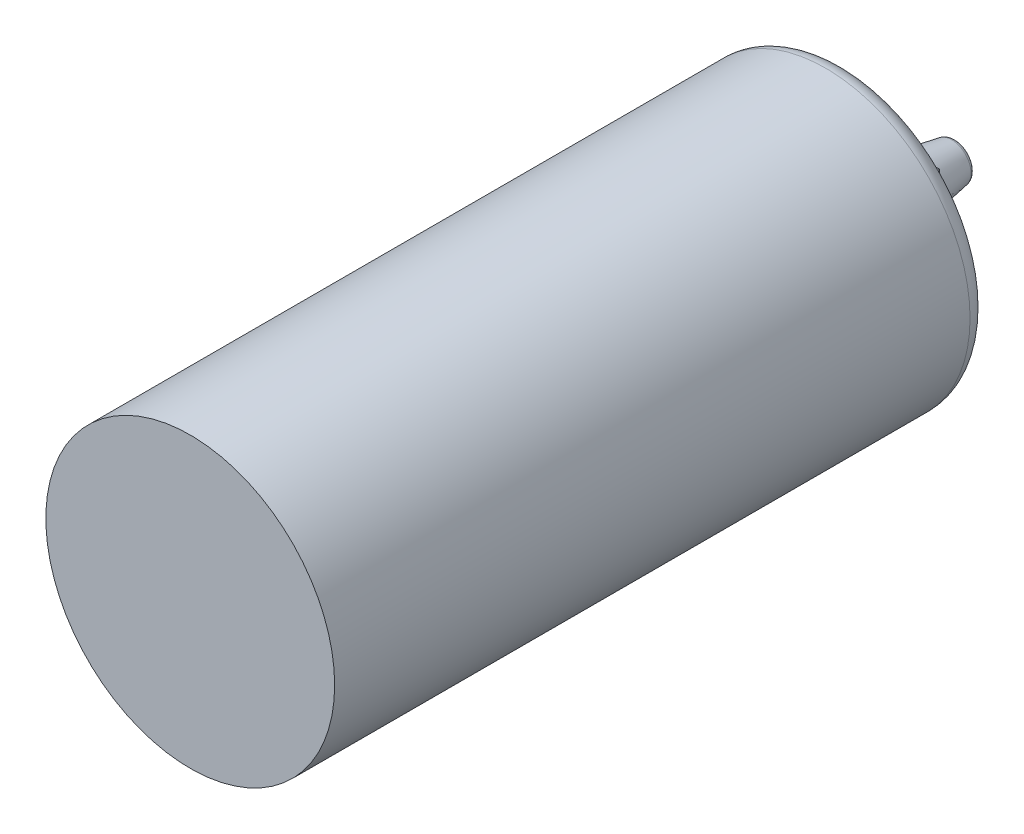
ISO-10303-21;
HEADER;
FILE_DESCRIPTION(('STEP AP214'),'2;1');
FILE_NAME('part.step','',(''),(''),'','','');
FILE_SCHEMA(('AUTOMOTIVE_DESIGN { 1 0 10303 214 1 1 1 1 }'));
ENDSEC;
DATA;
#1=APPLICATION_CONTEXT('core data for automotive mechanical design processes');
#2=APPLICATION_PROTOCOL_DEFINITION('international standard','automotive_design',2000,#1);
#3=PRODUCT_CONTEXT('',#1,'mechanical');
#4=PRODUCT('Part','Part','',(#3));
#5=PRODUCT_RELATED_PRODUCT_CATEGORY('part','',(#4));
#6=PRODUCT_DEFINITION_FORMATION('','',#4);
#7=PRODUCT_DEFINITION_CONTEXT('part definition',#1,'design');
#8=PRODUCT_DEFINITION('design','',#6,#7);
#9=PRODUCT_DEFINITION_SHAPE('','',#8);
#10=(LENGTH_UNIT() NAMED_UNIT(*) SI_UNIT(.MILLI.,.METRE.));
#11=(NAMED_UNIT(*) PLANE_ANGLE_UNIT() SI_UNIT($,.RADIAN.));
#12=(NAMED_UNIT(*) SI_UNIT($,.STERADIAN.) SOLID_ANGLE_UNIT());
#13=UNCERTAINTY_MEASURE_WITH_UNIT(LENGTH_MEASURE(1.E-05),#10,'distance_accuracy_value','');
#14=(GEOMETRIC_REPRESENTATION_CONTEXT(3) GLOBAL_UNCERTAINTY_ASSIGNED_CONTEXT((#13)) GLOBAL_UNIT_ASSIGNED_CONTEXT((#10,
#11,#12)) REPRESENTATION_CONTEXT('',''));
#15=CARTESIAN_POINT('',(0.,0.,0.));
#16=DIRECTION('',(0.,0.,1.));
#17=DIRECTION('',(1.,0.,0.));
#18=AXIS2_PLACEMENT_3D('',#15,#16,#17);
#19=CARTESIAN_POINT('',(0.,0.,-1.27));
#20=DIRECTION('',(0.,0.,1.));
#21=DIRECTION('',(1.,0.,0.));
#22=AXIS2_PLACEMENT_3D('',#19,#20,#21);
#23=PLANE('',#22);
#24=CARTESIAN_POINT('',(5.715,-5.715,-1.27));
#25=DIRECTION('',(0.,0.,1.));
#26=DIRECTION('',(1.,0.,0.));
#27=AXIS2_PLACEMENT_3D('',#24,#25,#26);
#28=CIRCLE('',#27,3.81);
#29=CARTESIAN_POINT('',(9.525,-5.715,-1.27));
#30=VERTEX_POINT('',#29);
#31=EDGE_CURVE('E147',#30,#30,#28,.F.);
#32=ORIENTED_EDGE('',*,*,#31,.F.);
#33=EDGE_LOOP('',(#32));
#34=FACE_BOUND('',#33,.T.);
#35=CARTESIAN_POINT('',(5.715,5.715,-1.27));
#36=DIRECTION('',(0.,0.,1.));
#37=DIRECTION('',(1.,0.,0.));
#38=AXIS2_PLACEMENT_3D('',#35,#36,#37);
#39=CIRCLE('',#38,3.81);
#40=CARTESIAN_POINT('',(9.525,5.715,-1.27));
#41=VERTEX_POINT('',#40);
#42=EDGE_CURVE('E141',#41,#41,#39,.F.);
#43=ORIENTED_EDGE('',*,*,#42,.F.);
#44=EDGE_LOOP('',(#43));
#45=FACE_BOUND('',#44,.T.);
#46=DIRECTION('',(0.,-1.,0.));
#47=VECTOR('',#46,1.);
#48=CARTESIAN_POINT('',(-11.2060647345003,0.,-1.27));
#49=LINE('',#48,#47);
#50=CARTESIAN_POINT('',(-11.2060647345003,-11.2060647345002,-1.27));
#51=VERTEX_POINT('',#50);
#52=CARTESIAN_POINT('',(-11.2060647345003,11.2060647345003,-1.27));
#53=VERTEX_POINT('',#52);
#54=EDGE_CURVE('E112',#51,#53,#49,.F.);
#55=ORIENTED_EDGE('',*,*,#54,.T.);
#56=DIRECTION('',(-1.,0.,0.));
#57=VECTOR('',#56,1.);
#58=CARTESIAN_POINT('',(0.,11.2060647345003,-1.27));
#59=LINE('',#58,#57);
#60=CARTESIAN_POINT('',(11.2060647345002,11.2060647345003,-1.27));
#61=VERTEX_POINT('',#60);
#62=EDGE_CURVE('E128',#53,#61,#59,.F.);
#63=ORIENTED_EDGE('',*,*,#62,.T.);
#64=DIRECTION('',(0.,1.,0.));
#65=VECTOR('',#64,1.);
#66=CARTESIAN_POINT('',(11.2060647345002,0.,-1.27));
#67=LINE('',#66,#65);
#68=CARTESIAN_POINT('',(11.2060647345002,-11.2060647345002,-1.27));
#69=VERTEX_POINT('',#68);
#70=EDGE_CURVE('E130',#61,#69,#67,.F.);
#71=ORIENTED_EDGE('',*,*,#70,.T.);
#72=DIRECTION('',(1.,0.,0.));
#73=VECTOR('',#72,1.);
#74=CARTESIAN_POINT('',(0.,-11.2060647345002,-1.27));
#75=LINE('',#74,#73);
#76=EDGE_CURVE('E121',#69,#51,#75,.F.);
#77=ORIENTED_EDGE('',*,*,#76,.T.);
#78=EDGE_LOOP('',(#55,#63,#71,#77));
#79=FACE_BOUND('',#78,.T.);
#80=CARTESIAN_POINT('',(-5.715,5.715,-1.27));
#81=DIRECTION('',(0.,0.,1.));
#82=DIRECTION('',(1.,0.,0.));
#83=AXIS2_PLACEMENT_3D('',#80,#81,#82);
#84=CIRCLE('',#83,3.81);
#85=CARTESIAN_POINT('',(-1.905,5.715,-1.27));
#86=VERTEX_POINT('',#85);
#87=EDGE_CURVE('E144',#86,#86,#84,.F.);
#88=ORIENTED_EDGE('',*,*,#87,.F.);
#89=EDGE_LOOP('',(#88));
#90=FACE_BOUND('',#89,.T.);
#91=CARTESIAN_POINT('',(-5.715,-5.715,-1.27));
#92=DIRECTION('',(0.,0.,1.));
#93=DIRECTION('',(1.,0.,0.));
#94=AXIS2_PLACEMENT_3D('',#91,#92,#93);
#95=CIRCLE('',#94,3.81);
#96=CARTESIAN_POINT('',(-1.905,-5.715,-1.27));
#97=VERTEX_POINT('',#96);
#98=EDGE_CURVE('E150',#97,#97,#95,.F.);
#99=ORIENTED_EDGE('',*,*,#98,.F.);
#100=EDGE_LOOP('',(#99));
#101=FACE_BOUND('',#100,.T.);
#102=ADVANCED_FACE('F35',(#34,#45,#79,#90,#101),#23,.F.);
#103=CARTESIAN_POINT('',(0.,0.,0.));
#104=DIRECTION('',(0.,0.,1.));
#105=DIRECTION('',(1.,0.,0.));
#106=AXIS2_PLACEMENT_3D('',#103,#104,#105);
#107=PLANE('',#106);
#108=CARTESIAN_POINT('',(0.,0.,0.));
#109=DIRECTION('',(0.,0.,1.));
#110=DIRECTION('',(1.,0.,0.));
#111=AXIS2_PLACEMENT_3D('',#108,#109,#110);
#112=CIRCLE('',#111,16.51);
#113=CARTESIAN_POINT('',(16.51,0.,0.));
#114=VERTEX_POINT('',#113);
#115=EDGE_CURVE('E138',#114,#114,#112,.F.);
#116=ORIENTED_EDGE('',*,*,#115,.T.);
#117=EDGE_LOOP('',(#116));
#118=FACE_BOUND('',#117,.T.);
#119=DIRECTION('',(0.,1.,0.));
#120=VECTOR('',#119,1.);
#121=CARTESIAN_POINT('',(-11.43,-11.43,0.));
#122=LINE('',#121,#120);
#123=CARTESIAN_POINT('',(-11.43,-11.43,0.));
#124=VERTEX_POINT('',#123);
#125=CARTESIAN_POINT('',(-11.43,11.43,0.));
#126=VERTEX_POINT('',#125);
#127=EDGE_CURVE('E104',#124,#126,#122,.T.);
#128=ORIENTED_EDGE('',*,*,#127,.F.);
#129=DIRECTION('',(-1.,0.,0.));
#130=VECTOR('',#129,1.);
#131=CARTESIAN_POINT('',(11.43,-11.43,0.));
#132=LINE('',#131,#130);
#133=CARTESIAN_POINT('',(11.43,-11.43,0.));
#134=VERTEX_POINT('',#133);
#135=EDGE_CURVE('E109',#134,#124,#132,.T.);
#136=ORIENTED_EDGE('',*,*,#135,.F.);
#137=DIRECTION('',(0.,-1.,0.));
#138=VECTOR('',#137,1.);
#139=CARTESIAN_POINT('',(11.43,-11.43,0.));
#140=LINE('',#139,#138);
#141=CARTESIAN_POINT('',(11.43,11.43,0.));
#142=VERTEX_POINT('',#141);
#143=EDGE_CURVE('E55',#142,#134,#140,.T.);
#144=ORIENTED_EDGE('',*,*,#143,.F.);
#145=DIRECTION('',(1.,0.,0.));
#146=VECTOR('',#145,1.);
#147=CARTESIAN_POINT('',(11.43,11.43,0.));
#148=LINE('',#147,#146);
#149=EDGE_CURVE('E50',#126,#142,#148,.T.);
#150=ORIENTED_EDGE('',*,*,#149,.F.);
#151=EDGE_LOOP('',(#128,#136,#144,#150));
#152=FACE_BOUND('',#151,.T.);
#153=ADVANCED_FACE('F190',(#118,#152),#107,.F.);
#154=CARTESIAN_POINT('',(0.,0.,86.36));
#155=DIRECTION('',(0.,0.,-1.));
#156=DIRECTION('',(-1.,0.,0.));
#157=AXIS2_PLACEMENT_3D('',#154,#155,#156);
#158=CYLINDRICAL_SURFACE('',#157,19.05);
#159=CARTESIAN_POINT('',(0.,0.,2.54));
#160=DIRECTION('',(0.,0.,1.));
#161=DIRECTION('',(1.,0.,0.));
#162=AXIS2_PLACEMENT_3D('',#159,#160,#161);
#163=CIRCLE('',#162,19.05);
#164=CARTESIAN_POINT('',(19.05,0.,2.54));
#165=VERTEX_POINT('',#164);
#166=EDGE_CURVE('E135',#165,#165,#163,.T.);
#167=ORIENTED_EDGE('',*,*,#166,.T.);
#168=EDGE_LOOP('',(#167));
#169=FACE_BOUND('',#168,.T.);
#170=CARTESIAN_POINT('',(0.,0.,86.36));
#171=DIRECTION('',(0.,0.,1.));
#172=DIRECTION('',(1.,0.,0.));
#173=AXIS2_PLACEMENT_3D('',#170,#171,#172);
#174=CIRCLE('',#173,19.05);
#175=CARTESIAN_POINT('',(19.05,0.,86.36));
#176=VERTEX_POINT('',#175);
#177=EDGE_CURVE('E115',#176,#176,#174,.T.);
#178=ORIENTED_EDGE('',*,*,#177,.F.);
#179=EDGE_LOOP('',(#178));
#180=FACE_BOUND('',#179,.T.);
#181=ADVANCED_FACE('F196',(#169,#180),#158,.T.);
#182=CARTESIAN_POINT('',(0.,0.,86.36));
#183=DIRECTION('',(0.,0.,1.));
#184=DIRECTION('',(1.,0.,0.));
#185=AXIS2_PLACEMENT_3D('',#182,#183,#184);
#186=PLANE('',#185);
#187=ORIENTED_EDGE('',*,*,#177,.T.);
#188=EDGE_LOOP('',(#187));
#189=FACE_BOUND('',#188,.T.);
#190=ADVANCED_FACE('F209',(#189),#186,.T.);
#191=CARTESIAN_POINT('',(-11.43,-11.43,0.));
#192=DIRECTION('',(-0.984807753012208,0.,-0.173648177666931));
#193=DIRECTION('',(-0.173648177666931,0.,0.984807753012208));
#194=AXIS2_PLACEMENT_3D('',#191,#192,#193);
#195=PLANE('',#194);
#196=ORIENTED_EDGE('',*,*,#127,.T.);
#197=DIRECTION('',(-0.171087869746036,0.171087869746036,0.970287525247814));
#198=VECTOR('',#197,1.);
#199=CARTESIAN_POINT('',(-10.760863587277,10.760863587277,-3.79486117232042));
#200=LINE('',#199,#198);
#201=EDGE_CURVE('E113',#53,#126,#200,.T.);
#202=ORIENTED_EDGE('',*,*,#201,.F.);
#203=ORIENTED_EDGE('',*,*,#54,.F.);
#204=DIRECTION('',(-0.171087869746036,-0.171087869746036,0.970287525247814));
#205=VECTOR('',#204,1.);
#206=CARTESIAN_POINT('',(-11.43,-11.43,0.));
#207=LINE('',#206,#205);
#208=EDGE_CURVE('E117',#51,#124,#207,.T.);
#209=ORIENTED_EDGE('',*,*,#208,.T.);
#210=EDGE_LOOP('',(#196,#202,#203,#209));
#211=FACE_BOUND('',#210,.T.);
#212=ADVANCED_FACE('F205',(#211),#195,.T.);
#213=CARTESIAN_POINT('',(11.43,11.43,0.));
#214=DIRECTION('',(0.,0.984807753012208,-0.173648177666931));
#215=DIRECTION('',(0.,0.173648177666931,0.984807753012208));
#216=AXIS2_PLACEMENT_3D('',#213,#214,#215);
#217=PLANE('',#216);
#218=ORIENTED_EDGE('',*,*,#149,.T.);
#219=DIRECTION('',(0.171087869746036,0.171087869746036,0.970287525247814));
#220=VECTOR('',#219,1.);
#221=CARTESIAN_POINT('',(10.7608635872769,10.760863587277,-3.79486117232042));
#222=LINE('',#221,#220);
#223=EDGE_CURVE('E116',#61,#142,#222,.T.);
#224=ORIENTED_EDGE('',*,*,#223,.F.);
#225=ORIENTED_EDGE('',*,*,#62,.F.);
#226=ORIENTED_EDGE('',*,*,#201,.T.);
#227=EDGE_LOOP('',(#218,#224,#225,#226));
#228=FACE_BOUND('',#227,.T.);
#229=ADVANCED_FACE('F208',(#228),#217,.T.);
#230=CARTESIAN_POINT('',(11.43,-11.43,0.));
#231=DIRECTION('',(0.984807753012208,0.,-0.173648177666931));
#232=DIRECTION('',(-0.173648177666931,0.,-0.984807753012208));
#233=AXIS2_PLACEMENT_3D('',#230,#231,#232);
#234=PLANE('',#233);
#235=ORIENTED_EDGE('',*,*,#143,.T.);
#236=DIRECTION('',(0.171087869746036,-0.171087869746036,0.970287525247814));
#237=VECTOR('',#236,1.);
#238=CARTESIAN_POINT('',(11.43,-11.43,0.));
#239=LINE('',#238,#237);
#240=EDGE_CURVE('E120',#69,#134,#239,.T.);
#241=ORIENTED_EDGE('',*,*,#240,.F.);
#242=ORIENTED_EDGE('',*,*,#70,.F.);
#243=ORIENTED_EDGE('',*,*,#223,.T.);
#244=EDGE_LOOP('',(#235,#241,#242,#243));
#245=FACE_BOUND('',#244,.T.);
#246=ADVANCED_FACE('F215',(#245),#234,.T.);
#247=CARTESIAN_POINT('',(11.43,-11.43,0.));
#248=DIRECTION('',(0.,-0.984807753012208,-0.173648177666931));
#249=DIRECTION('',(0.,0.173648177666931,-0.984807753012208));
#250=AXIS2_PLACEMENT_3D('',#247,#248,#249);
#251=PLANE('',#250);
#252=ORIENTED_EDGE('',*,*,#135,.T.);
#253=ORIENTED_EDGE('',*,*,#208,.F.);
#254=ORIENTED_EDGE('',*,*,#76,.F.);
#255=ORIENTED_EDGE('',*,*,#240,.T.);
#256=EDGE_LOOP('',(#252,#253,#254,#255));
#257=FACE_BOUND('',#256,.T.);
#258=ADVANCED_FACE('F211',(#257),#251,.T.);
#259=CARTESIAN_POINT('',(0.,0.,2.54));
#260=DIRECTION('',(0.,0.,1.));
#261=DIRECTION('',(1.,0.,0.));
#262=AXIS2_PLACEMENT_3D('',#259,#260,#261);
#263=TOROIDAL_SURFACE('',#262,16.51,2.54);
#264=ORIENTED_EDGE('',*,*,#115,.F.);
#265=EDGE_LOOP('',(#264));
#266=FACE_BOUND('',#265,.T.);
#267=ORIENTED_EDGE('',*,*,#166,.F.);
#268=EDGE_LOOP('',(#267));
#269=FACE_BOUND('',#268,.T.);
#270=ADVANCED_FACE('F214',(#266,#269),#263,.T.);
#271=CARTESIAN_POINT('',(5.715,5.715,-1.27));
#272=DIRECTION('',(0.,0.,1.));
#273=DIRECTION('',(-1.,0.,0.));
#274=AXIS2_PLACEMENT_3D('',#271,#272,#273);
#275=CONICAL_SURFACE('',#274,3.81,0.174532925199433);
#276=CARTESIAN_POINT('',(5.715,5.715,-8.3652665928185));
#277=DIRECTION('',(0.,0.,1.));
#278=DIRECTION('',(1.,0.,0.));
#279=AXIS2_PLACEMENT_3D('',#276,#277,#278);
#280=CIRCLE('',#279,2.55891306436667);
#281=CARTESIAN_POINT('',(8.27391306436667,5.715,-8.3652665928185));
#282=VERTEX_POINT('',#281);
#283=EDGE_CURVE('E11',#282,#282,#280,.T.);
#284=ORIENTED_EDGE('',*,*,#283,.T.);
#285=EDGE_LOOP('',(#284));
#286=FACE_BOUND('',#285,.T.);
#287=ORIENTED_EDGE('',*,*,#42,.T.);
#288=EDGE_LOOP('',(#287));
#289=FACE_BOUND('',#288,.T.);
#290=ADVANCED_FACE('F203',(#286,#289),#275,.T.);
#291=CARTESIAN_POINT('',(5.715,5.715,-8.89));
#292=DIRECTION('',(0.,0.,-1.));
#293=DIRECTION('',(-1.,0.,0.));
#294=AXIS2_PLACEMENT_3D('',#291,#292,#293);
#295=PLANE('',#294);
#296=CARTESIAN_POINT('',(5.715,5.715,-8.89));
#297=DIRECTION('',(0.,0.,-1.));
#298=DIRECTION('',(-1.,0.,0.));
#299=AXIS2_PLACEMENT_3D('',#296,#297,#298);
#300=CIRCLE('',#299,1.27);
#301=CARTESIAN_POINT('',(4.445,5.715,-8.89));
#302=VERTEX_POINT('',#301);
#303=EDGE_CURVE('E101',#302,#302,#300,.T.);
#304=ORIENTED_EDGE('',*,*,#303,.F.);
#305=EDGE_LOOP('',(#304));
#306=FACE_BOUND('',#305,.T.);
#307=CARTESIAN_POINT('',(5.715,5.715,-8.89));
#308=DIRECTION('',(0.,0.,-1.));
#309=DIRECTION('',(-1.,0.,0.));
#310=AXIS2_PLACEMENT_3D('',#307,#308,#309);
#311=CIRCLE('',#310,1.93356014120392);
#312=CARTESIAN_POINT('',(3.78143985879608,5.715,-8.89));
#313=VERTEX_POINT('',#312);
#314=EDGE_CURVE('E43',#313,#313,#311,.T.);
#315=ORIENTED_EDGE('',*,*,#314,.T.);
#316=EDGE_LOOP('',(#315));
#317=FACE_BOUND('',#316,.T.);
#318=ADVANCED_FACE('F173',(#306,#317),#295,.T.);
#319=CARTESIAN_POINT('',(-5.715,5.715,-1.27));
#320=DIRECTION('',(0.,0.,1.));
#321=DIRECTION('',(-1.,0.,0.));
#322=AXIS2_PLACEMENT_3D('',#319,#320,#321);
#323=CONICAL_SURFACE('',#322,3.81,0.174532925199433);
#324=CARTESIAN_POINT('',(-5.715,5.715,-8.3652665928185));
#325=DIRECTION('',(0.,0.,1.));
#326=DIRECTION('',(1.,0.,0.));
#327=AXIS2_PLACEMENT_3D('',#324,#325,#326);
#328=CIRCLE('',#327,2.55891306436667);
#329=CARTESIAN_POINT('',(-3.15608693563333,5.715,-8.3652665928185));
#330=VERTEX_POINT('',#329);
#331=EDGE_CURVE('E168',#330,#330,#328,.T.);
#332=ORIENTED_EDGE('',*,*,#331,.T.);
#333=EDGE_LOOP('',(#332));
#334=FACE_BOUND('',#333,.T.);
#335=ORIENTED_EDGE('',*,*,#87,.T.);
#336=EDGE_LOOP('',(#335));
#337=FACE_BOUND('',#336,.T.);
#338=ADVANCED_FACE('F267',(#334,#337),#323,.T.);
#339=CARTESIAN_POINT('',(-5.715,5.715,-8.89));
#340=DIRECTION('',(0.,0.,-1.));
#341=DIRECTION('',(-1.,0.,0.));
#342=AXIS2_PLACEMENT_3D('',#339,#340,#341);
#343=PLANE('',#342);
#344=CARTESIAN_POINT('',(-5.715,5.715,-8.89));
#345=DIRECTION('',(0.,0.,-1.));
#346=DIRECTION('',(-1.,0.,0.));
#347=AXIS2_PLACEMENT_3D('',#344,#345,#346);
#348=CIRCLE('',#347,1.27);
#349=CARTESIAN_POINT('',(-6.985,5.715,-8.89));
#350=VERTEX_POINT('',#349);
#351=EDGE_CURVE('E96',#350,#350,#348,.T.);
#352=ORIENTED_EDGE('',*,*,#351,.F.);
#353=EDGE_LOOP('',(#352));
#354=FACE_BOUND('',#353,.T.);
#355=CARTESIAN_POINT('',(-5.715,5.715,-8.89));
#356=DIRECTION('',(0.,0.,-1.));
#357=DIRECTION('',(-1.,0.,0.));
#358=AXIS2_PLACEMENT_3D('',#355,#356,#357);
#359=CIRCLE('',#358,1.93356014120392);
#360=CARTESIAN_POINT('',(-7.64856014120392,5.715,-8.89));
#361=VERTEX_POINT('',#360);
#362=EDGE_CURVE('E165',#361,#361,#359,.T.);
#363=ORIENTED_EDGE('',*,*,#362,.T.);
#364=EDGE_LOOP('',(#363));
#365=FACE_BOUND('',#364,.T.);
#366=ADVANCED_FACE('F263',(#354,#365),#343,.T.);
#367=CARTESIAN_POINT('',(5.715,-5.715,-1.27));
#368=DIRECTION('',(0.,0.,1.));
#369=DIRECTION('',(-1.,0.,0.));
#370=AXIS2_PLACEMENT_3D('',#367,#368,#369);
#371=CONICAL_SURFACE('',#370,3.81,0.174532925199433);
#372=CARTESIAN_POINT('',(5.715,-5.715,-8.3652665928185));
#373=DIRECTION('',(0.,0.,1.));
#374=DIRECTION('',(1.,0.,0.));
#375=AXIS2_PLACEMENT_3D('',#372,#373,#374);
#376=CIRCLE('',#375,2.55891306436667);
#377=CARTESIAN_POINT('',(8.27391306436667,-5.715,-8.3652665928185));
#378=VERTEX_POINT('',#377);
#379=EDGE_CURVE('E156',#378,#378,#376,.T.);
#380=ORIENTED_EDGE('',*,*,#379,.T.);
#381=EDGE_LOOP('',(#380));
#382=FACE_BOUND('',#381,.T.);
#383=ORIENTED_EDGE('',*,*,#31,.T.);
#384=EDGE_LOOP('',(#383));
#385=FACE_BOUND('',#384,.T.);
#386=ADVANCED_FACE('F260',(#382,#385),#371,.T.);
#387=CARTESIAN_POINT('',(5.715,-5.715,-8.89));
#388=DIRECTION('',(0.,0.,-1.));
#389=DIRECTION('',(-1.,0.,0.));
#390=AXIS2_PLACEMENT_3D('',#387,#388,#389);
#391=PLANE('',#390);
#392=CARTESIAN_POINT('',(5.715,-5.715,-8.89));
#393=DIRECTION('',(0.,0.,-1.));
#394=DIRECTION('',(-1.,0.,0.));
#395=AXIS2_PLACEMENT_3D('',#392,#393,#394);
#396=CIRCLE('',#395,1.27);
#397=CARTESIAN_POINT('',(4.445,-5.715,-8.89));
#398=VERTEX_POINT('',#397);
#399=EDGE_CURVE('E91',#398,#398,#396,.T.);
#400=ORIENTED_EDGE('',*,*,#399,.F.);
#401=EDGE_LOOP('',(#400));
#402=FACE_BOUND('',#401,.T.);
#403=CARTESIAN_POINT('',(5.715,-5.715,-8.89));
#404=DIRECTION('',(0.,0.,-1.));
#405=DIRECTION('',(-1.,0.,0.));
#406=AXIS2_PLACEMENT_3D('',#403,#404,#405);
#407=CIRCLE('',#406,1.93356014120392);
#408=CARTESIAN_POINT('',(3.78143985879608,-5.715,-8.89));
#409=VERTEX_POINT('',#408);
#410=EDGE_CURVE('E153',#409,#409,#407,.T.);
#411=ORIENTED_EDGE('',*,*,#410,.T.);
#412=EDGE_LOOP('',(#411));
#413=FACE_BOUND('',#412,.T.);
#414=ADVANCED_FACE('F252',(#402,#413),#391,.T.);
#415=CARTESIAN_POINT('',(-5.715,-5.715,-1.27));
#416=DIRECTION('',(0.,0.,1.));
#417=DIRECTION('',(-1.,0.,0.));
#418=AXIS2_PLACEMENT_3D('',#415,#416,#417);
#419=CONICAL_SURFACE('',#418,3.81,0.174532925199433);
#420=CARTESIAN_POINT('',(-5.715,-5.715,-8.3652665928185));
#421=DIRECTION('',(0.,0.,1.));
#422=DIRECTION('',(1.,0.,0.));
#423=AXIS2_PLACEMENT_3D('',#420,#421,#422);
#424=CIRCLE('',#423,2.55891306436667);
#425=CARTESIAN_POINT('',(-3.15608693563333,-5.715,-8.3652665928185));
#426=VERTEX_POINT('',#425);
#427=EDGE_CURVE('E162',#426,#426,#424,.T.);
#428=ORIENTED_EDGE('',*,*,#427,.T.);
#429=EDGE_LOOP('',(#428));
#430=FACE_BOUND('',#429,.T.);
#431=ORIENTED_EDGE('',*,*,#98,.T.);
#432=EDGE_LOOP('',(#431));
#433=FACE_BOUND('',#432,.T.);
#434=ADVANCED_FACE('F246',(#430,#433),#419,.T.);
#435=CARTESIAN_POINT('',(-5.715,-5.715,-8.89));
#436=DIRECTION('',(0.,0.,-1.));
#437=DIRECTION('',(-1.,0.,0.));
#438=AXIS2_PLACEMENT_3D('',#435,#436,#437);
#439=PLANE('',#438);
#440=CARTESIAN_POINT('',(-5.715,-5.715,-8.89));
#441=DIRECTION('',(0.,0.,-1.));
#442=DIRECTION('',(-1.,0.,0.));
#443=AXIS2_PLACEMENT_3D('',#440,#441,#442);
#444=CIRCLE('',#443,1.27);
#445=CARTESIAN_POINT('',(-6.985,-5.715,-8.89));
#446=VERTEX_POINT('',#445);
#447=EDGE_CURVE('E93',#446,#446,#444,.T.);
#448=ORIENTED_EDGE('',*,*,#447,.F.);
#449=EDGE_LOOP('',(#448));
#450=FACE_BOUND('',#449,.T.);
#451=CARTESIAN_POINT('',(-5.715,-5.715,-8.89));
#452=DIRECTION('',(0.,0.,-1.));
#453=DIRECTION('',(-1.,0.,0.));
#454=AXIS2_PLACEMENT_3D('',#451,#452,#453);
#455=CIRCLE('',#454,1.93356014120392);
#456=CARTESIAN_POINT('',(-7.64856014120392,-5.715,-8.89));
#457=VERTEX_POINT('',#456);
#458=EDGE_CURVE('E159',#457,#457,#455,.T.);
#459=ORIENTED_EDGE('',*,*,#458,.T.);
#460=EDGE_LOOP('',(#459));
#461=FACE_BOUND('',#460,.T.);
#462=ADVANCED_FACE('F235',(#450,#461),#439,.T.);
#463=CARTESIAN_POINT('',(5.715,-5.715,-8.255));
#464=DIRECTION('',(0.,0.,-1.));
#465=DIRECTION('',(-1.,0.,0.));
#466=AXIS2_PLACEMENT_3D('',#463,#464,#465);
#467=TOROIDAL_SURFACE('',#466,1.93356014120392,0.635);
#468=ORIENTED_EDGE('',*,*,#379,.F.);
#469=EDGE_LOOP('',(#468));
#470=FACE_BOUND('',#469,.T.);
#471=ORIENTED_EDGE('',*,*,#410,.F.);
#472=EDGE_LOOP('',(#471));
#473=FACE_BOUND('',#472,.T.);
#474=ADVANCED_FACE('F232',(#470,#473),#467,.T.);
#475=CARTESIAN_POINT('',(-5.715,-5.715,-8.255));
#476=DIRECTION('',(0.,0.,-1.));
#477=DIRECTION('',(-1.,0.,0.));
#478=AXIS2_PLACEMENT_3D('',#475,#476,#477);
#479=TOROIDAL_SURFACE('',#478,1.93356014120392,0.635);
#480=ORIENTED_EDGE('',*,*,#427,.F.);
#481=EDGE_LOOP('',(#480));
#482=FACE_BOUND('',#481,.T.);
#483=ORIENTED_EDGE('',*,*,#458,.F.);
#484=EDGE_LOOP('',(#483));
#485=FACE_BOUND('',#484,.T.);
#486=ADVANCED_FACE('F186',(#482,#485),#479,.T.);
#487=CARTESIAN_POINT('',(-5.715,5.715,-8.255));
#488=DIRECTION('',(0.,0.,-1.));
#489=DIRECTION('',(-1.,0.,0.));
#490=AXIS2_PLACEMENT_3D('',#487,#488,#489);
#491=TOROIDAL_SURFACE('',#490,1.93356014120392,0.635);
#492=ORIENTED_EDGE('',*,*,#331,.F.);
#493=EDGE_LOOP('',(#492));
#494=FACE_BOUND('',#493,.T.);
#495=ORIENTED_EDGE('',*,*,#362,.F.);
#496=EDGE_LOOP('',(#495));
#497=FACE_BOUND('',#496,.T.);
#498=ADVANCED_FACE('F177',(#494,#497),#491,.T.);
#499=CARTESIAN_POINT('',(5.715,5.715,-8.255));
#500=DIRECTION('',(0.,0.,-1.));
#501=DIRECTION('',(-1.,0.,0.));
#502=AXIS2_PLACEMENT_3D('',#499,#500,#501);
#503=TOROIDAL_SURFACE('',#502,1.93356014120392,0.635);
#504=ORIENTED_EDGE('',*,*,#283,.F.);
#505=EDGE_LOOP('',(#504));
#506=FACE_BOUND('',#505,.T.);
#507=ORIENTED_EDGE('',*,*,#314,.F.);
#508=EDGE_LOOP('',(#507));
#509=FACE_BOUND('',#508,.T.);
#510=ADVANCED_FACE('F37',(#506,#509),#503,.T.);
#511=CARTESIAN_POINT('',(5.715,5.715,-8.89));
#512=DIRECTION('',(0.,0.,-1.));
#513=DIRECTION('',(-1.,0.,0.));
#514=AXIS2_PLACEMENT_3D('',#511,#512,#513);
#515=CONICAL_SURFACE('',#514,1.27,0.0872664625997167);
#516=CARTESIAN_POINT('',(5.715,5.715,5.62616642450688));
#517=VERTEX_POINT('',#516);
#518=VERTEX_LOOP('',#517);
#519=FACE_BOUND('',#518,.T.);
#520=ORIENTED_EDGE('',*,*,#303,.T.);
#521=EDGE_LOOP('',(#520));
#522=FACE_BOUND('',#521,.T.);
#523=ADVANCED_FACE('F176',(#519,#522),#515,.F.);
#524=CARTESIAN_POINT('',(-5.715,5.715,-8.89));
#525=DIRECTION('',(0.,0.,-1.));
#526=DIRECTION('',(-1.,0.,0.));
#527=AXIS2_PLACEMENT_3D('',#524,#525,#526);
#528=CONICAL_SURFACE('',#527,1.27,0.0872664625997167);
#529=CARTESIAN_POINT('',(-5.715,5.715,5.62616642450688));
#530=VERTEX_POINT('',#529);
#531=VERTEX_LOOP('',#530);
#532=FACE_BOUND('',#531,.T.);
#533=ORIENTED_EDGE('',*,*,#351,.T.);
#534=EDGE_LOOP('',(#533));
#535=FACE_BOUND('',#534,.T.);
#536=ADVANCED_FACE('F183',(#532,#535),#528,.F.);
#537=CARTESIAN_POINT('',(-5.715,-5.715,-8.89));
#538=DIRECTION('',(0.,0.,-1.));
#539=DIRECTION('',(-1.,0.,0.));
#540=AXIS2_PLACEMENT_3D('',#537,#538,#539);
#541=CONICAL_SURFACE('',#540,1.27,0.0872664625997167);
#542=CARTESIAN_POINT('',(-5.715,-5.715,5.62616642450688));
#543=VERTEX_POINT('',#542);
#544=VERTEX_LOOP('',#543);
#545=FACE_BOUND('',#544,.T.);
#546=ORIENTED_EDGE('',*,*,#447,.T.);
#547=EDGE_LOOP('',(#546));
#548=FACE_BOUND('',#547,.T.);
#549=ADVANCED_FACE('F87',(#545,#548),#541,.F.);
#550=CARTESIAN_POINT('',(5.715,-5.715,-8.89));
#551=DIRECTION('',(0.,0.,-1.));
#552=DIRECTION('',(-1.,0.,0.));
#553=AXIS2_PLACEMENT_3D('',#550,#551,#552);
#554=CONICAL_SURFACE('',#553,1.27,0.0872664625997167);
#555=CARTESIAN_POINT('',(5.715,-5.715,5.62616642450688));
#556=VERTEX_POINT('',#555);
#557=VERTEX_LOOP('',#556);
#558=FACE_BOUND('',#557,.T.);
#559=ORIENTED_EDGE('',*,*,#399,.T.);
#560=EDGE_LOOP('',(#559));
#561=FACE_BOUND('',#560,.T.);
#562=ADVANCED_FACE('F84',(#558,#561),#554,.F.);
#563=CLOSED_SHELL('',(#102,#153,#181,#190,#212,#229,#246,#258,#270,#290,#318,#338,#366,#386,
#414,#434,#462,#474,#486,#498,#510,#523,#536,#549,#562));
#564=MANIFOLD_SOLID_BREP('B2',#563);
#565=ADVANCED_BREP_SHAPE_REPRESENTATION('',(#18,#564),#14);
#566=SHAPE_DEFINITION_REPRESENTATION(#9,#565);
ENDSEC;
END-ISO-10303-21;
